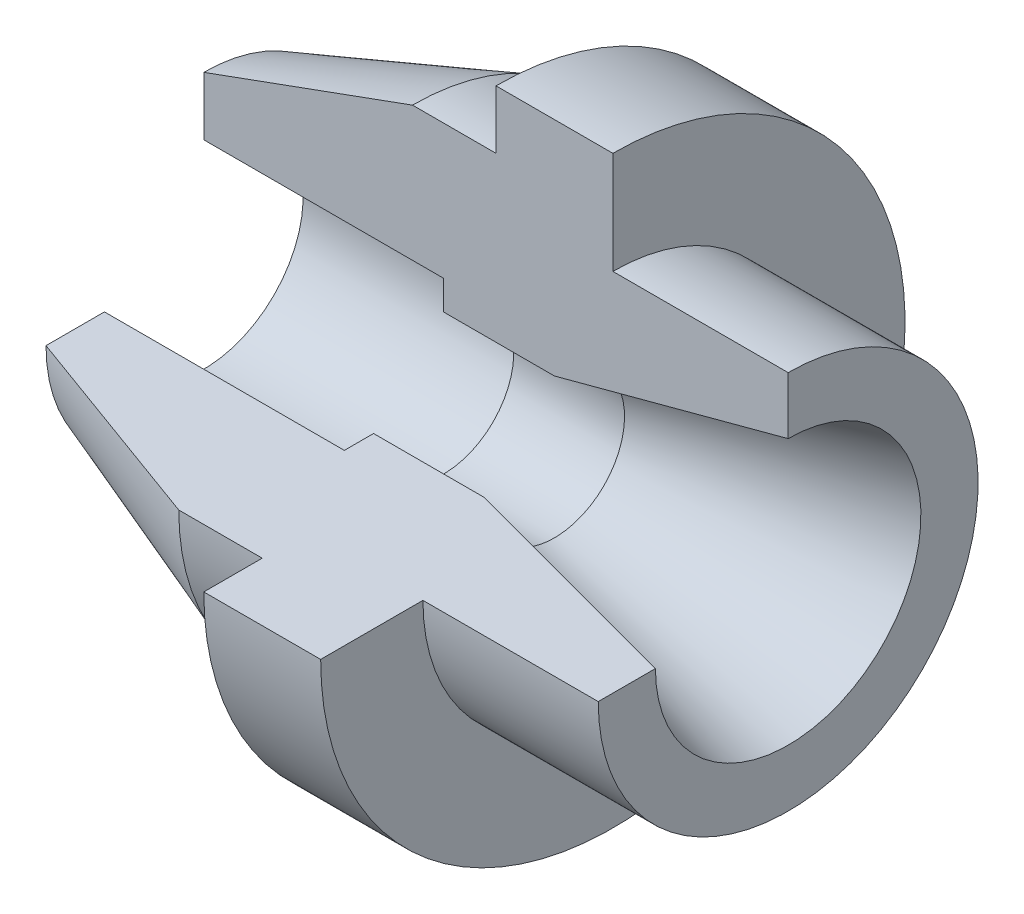
ISO-10303-21;
HEADER;
FILE_DESCRIPTION(('STEP AP214'),'2;1');
FILE_NAME('part.step','',(''),(''),'','','');
FILE_SCHEMA(('AUTOMOTIVE_DESIGN { 1 0 10303 214 1 1 1 1 }'));
ENDSEC;
DATA;
#1=APPLICATION_CONTEXT('core data for automotive mechanical design processes');
#2=APPLICATION_PROTOCOL_DEFINITION('international standard','automotive_design',2000,#1);
#3=PRODUCT_CONTEXT('',#1,'mechanical');
#4=PRODUCT('Part','Part','',(#3));
#5=PRODUCT_RELATED_PRODUCT_CATEGORY('part','',(#4));
#6=PRODUCT_DEFINITION_FORMATION('','',#4);
#7=PRODUCT_DEFINITION_CONTEXT('part definition',#1,'design');
#8=PRODUCT_DEFINITION('design','',#6,#7);
#9=PRODUCT_DEFINITION_SHAPE('','',#8);
#10=(LENGTH_UNIT() NAMED_UNIT(*) SI_UNIT(.MILLI.,.METRE.));
#11=(NAMED_UNIT(*) PLANE_ANGLE_UNIT() SI_UNIT($,.RADIAN.));
#12=(NAMED_UNIT(*) SI_UNIT($,.STERADIAN.) SOLID_ANGLE_UNIT());
#13=UNCERTAINTY_MEASURE_WITH_UNIT(LENGTH_MEASURE(1.E-05),#10,'distance_accuracy_value','');
#14=(GEOMETRIC_REPRESENTATION_CONTEXT(3) GLOBAL_UNCERTAINTY_ASSIGNED_CONTEXT((#13)) GLOBAL_UNIT_ASSIGNED_CONTEXT((#10,
#11,#12)) REPRESENTATION_CONTEXT('',''));
#15=CARTESIAN_POINT('',(0.,0.,0.));
#16=DIRECTION('',(0.,0.,1.));
#17=DIRECTION('',(1.,0.,0.));
#18=AXIS2_PLACEMENT_3D('',#15,#16,#17);
#19=CARTESIAN_POINT('',(0.,0.,0.));
#20=DIRECTION('',(0.,1.,0.));
#21=DIRECTION('',(-1.,0.,0.));
#22=AXIS2_PLACEMENT_3D('',#19,#20,#21);
#23=PLANE('',#22);
#24=DIRECTION('',(0.,0.,-1.));
#25=VECTOR('',#24,1.);
#26=CARTESIAN_POINT('',(45.4775032273314,3.40419430537206E-13,32.5));
#27=LINE('',#26,#25);
#28=CARTESIAN_POINT('',(45.4775032273314,3.40419430537206E-13,32.5));
#29=VERTEX_POINT('',#28);
#30=CARTESIAN_POINT('',(45.4775032273315,2.37958080814109E-13,22.7179676972443));
#31=VERTEX_POINT('',#30);
#32=EDGE_CURVE('E163',#29,#31,#27,.T.);
#33=ORIENTED_EDGE('',*,*,#32,.T.);
#34=DIRECTION('',(0.965925826289071,0.,0.258819045102511));
#35=VECTOR('',#34,1.);
#36=CARTESIAN_POINT('',(-39.3071064634961,0.,0.));
#37=LINE('',#36,#35);
#38=CARTESIAN_POINT('',(5.47750322733145,2.97691547303661E-13,11.9999999999998));
#39=VERTEX_POINT('',#38);
#40=EDGE_CURVE('E279',#31,#39,#37,.F.);
#41=ORIENTED_EDGE('',*,*,#40,.T.);
#42=DIRECTION('',(-1.,0.,0.));
#43=VECTOR('',#42,1.);
#44=CARTESIAN_POINT('',(-54.5224967726686,1.25693328198351E-13,11.9999999999998));
#45=LINE('',#44,#43);
#46=CARTESIAN_POINT('',(-13.4717319359584,1.25693328198351E-13,11.9999999999999));
#47=VERTEX_POINT('',#46);
#48=EDGE_CURVE('E276',#39,#47,#45,.T.);
#49=ORIENTED_EDGE('',*,*,#48,.T.);
#50=DIRECTION('',(0.,0.,1.));
#51=VECTOR('',#50,1.);
#52=CARTESIAN_POINT('',(-13.4717319359584,0.,0.));
#53=LINE('',#52,#51);
#54=CARTESIAN_POINT('',(-13.4717319359584,2.47937938225147E-13,16.9999999999999));
#55=VERTEX_POINT('',#54);
#56=EDGE_CURVE('E155',#47,#55,#53,.T.);
#57=ORIENTED_EDGE('',*,*,#56,.T.);
#58=DIRECTION('',(-1.,0.,0.));
#59=VECTOR('',#58,1.);
#60=CARTESIAN_POINT('',(-54.5224967726686,1.78065548280999E-13,16.9999999999999));
#61=LINE('',#60,#59);
#62=CARTESIAN_POINT('',(-54.5224967726685,2.47937938225148E-13,17.));
#63=VERTEX_POINT('',#62);
#64=EDGE_CURVE('E138',#55,#63,#61,.T.);
#65=ORIENTED_EDGE('',*,*,#64,.T.);
#66=DIRECTION('',(0.,0.,-1.));
#67=VECTOR('',#66,1.);
#68=CARTESIAN_POINT('',(-54.5224967726686,2.82809988446294E-13,27.));
#69=LINE('',#68,#67);
#70=CARTESIAN_POINT('',(-54.5224967726686,2.82809988446294E-13,27.));
#71=VERTEX_POINT('',#70);
#72=EDGE_CURVE('E152',#71,#63,#69,.T.);
#73=ORIENTED_EDGE('',*,*,#72,.F.);
#74=DIRECTION('',(0.93969262078591,0.,0.342020143325665));
#75=VECTOR('',#74,1.);
#76=CARTESIAN_POINT('',(-54.5224967726686,2.82809988446294E-13,27.));
#77=LINE('',#76,#75);
#78=CARTESIAN_POINT('',(-18.8052903197581,4.18977760661176E-13,40.));
#79=VERTEX_POINT('',#78);
#80=EDGE_CURVE('E162',#71,#79,#77,.T.);
#81=ORIENTED_EDGE('',*,*,#80,.T.);
#82=DIRECTION('',(1.,0.,0.));
#83=VECTOR('',#82,1.);
#84=CARTESIAN_POINT('',(-18.8052903197581,4.18977760661176E-13,40.));
#85=LINE('',#84,#83);
#86=CARTESIAN_POINT('',(-4.52249677266856,4.18977760661176E-13,40.));
#87=VERTEX_POINT('',#86);
#88=EDGE_CURVE('E167',#79,#87,#85,.T.);
#89=ORIENTED_EDGE('',*,*,#88,.T.);
#90=DIRECTION('',(0.,0.,1.));
#91=VECTOR('',#90,1.);
#92=CARTESIAN_POINT('',(-4.52249677266856,4.18977760661176E-13,40.));
#93=LINE('',#92,#91);
#94=CARTESIAN_POINT('',(-4.52249677266857,5.2372220082647E-13,50.));
#95=VERTEX_POINT('',#94);
#96=EDGE_CURVE('E176',#87,#95,#93,.T.);
#97=ORIENTED_EDGE('',*,*,#96,.T.);
#98=DIRECTION('',(1.,0.,0.));
#99=VECTOR('',#98,1.);
#100=CARTESIAN_POINT('',(-4.52249677266857,5.2372220082647E-13,50.));
#101=LINE('',#100,#99);
#102=CARTESIAN_POINT('',(15.4775032273314,5.2372220082647E-13,50.));
#103=VERTEX_POINT('',#102);
#104=EDGE_CURVE('E180',#95,#103,#101,.T.);
#105=ORIENTED_EDGE('',*,*,#104,.T.);
#106=DIRECTION('',(0.,0.,-1.));
#107=VECTOR('',#106,1.);
#108=CARTESIAN_POINT('',(15.4775032273314,5.2372220082647E-13,50.));
#109=LINE('',#108,#107);
#110=CARTESIAN_POINT('',(15.4775032273314,3.40419430537206E-13,32.5));
#111=VERTEX_POINT('',#110);
#112=EDGE_CURVE('E184',#103,#111,#109,.T.);
#113=ORIENTED_EDGE('',*,*,#112,.T.);
#114=DIRECTION('',(1.,0.,0.));
#115=VECTOR('',#114,1.);
#116=CARTESIAN_POINT('',(15.4775032273314,3.40419430537206E-13,32.5));
#117=LINE('',#116,#115);
#118=EDGE_CURVE('E169',#111,#29,#117,.T.);
#119=ORIENTED_EDGE('',*,*,#118,.T.);
#120=EDGE_LOOP('',(#33,#41,#49,#57,#65,#73,#81,#89,#97,#105,#113,#119));
#121=FACE_BOUND('',#120,.T.);
#122=ADVANCED_FACE('F47',(#121),#23,.T.);
#123=CARTESIAN_POINT('',(0.,0.,0.));
#124=DIRECTION('',(0.,0.,-1.));
#125=DIRECTION('',(-1.,0.,0.));
#126=AXIS2_PLACEMENT_3D('',#123,#124,#125);
#127=PLANE('',#126);
#128=DIRECTION('',(0.96592582628907,0.258819045102515,0.));
#129=VECTOR('',#128,1.);
#130=CARTESIAN_POINT('',(-39.3071064634961,0.,0.));
#131=LINE('',#130,#129);
#132=CARTESIAN_POINT('',(45.4775032273314,22.7179676972446,0.));
#133=VERTEX_POINT('',#132);
#134=CARTESIAN_POINT('',(5.47750322733141,12.,0.));
#135=VERTEX_POINT('',#134);
#136=EDGE_CURVE('E11',#133,#135,#131,.F.);
#137=ORIENTED_EDGE('',*,*,#136,.F.);
#138=DIRECTION('',(0.,-1.,0.));
#139=VECTOR('',#138,1.);
#140=CARTESIAN_POINT('',(45.4775032273314,32.5,0.));
#141=LINE('',#140,#139);
#142=CARTESIAN_POINT('',(45.4775032273314,32.5,0.));
#143=VERTEX_POINT('',#142);
#144=EDGE_CURVE('E235',#143,#133,#141,.T.);
#145=ORIENTED_EDGE('',*,*,#144,.F.);
#146=DIRECTION('',(1.,0.,0.));
#147=VECTOR('',#146,1.);
#148=CARTESIAN_POINT('',(15.4775032273314,32.5,0.));
#149=LINE('',#148,#147);
#150=CARTESIAN_POINT('',(15.4775032273314,32.5,0.));
#151=VERTEX_POINT('',#150);
#152=EDGE_CURVE('E242',#151,#143,#149,.T.);
#153=ORIENTED_EDGE('',*,*,#152,.F.);
#154=DIRECTION('',(0.,-1.,0.));
#155=VECTOR('',#154,1.);
#156=CARTESIAN_POINT('',(15.4775032273314,50.,0.));
#157=LINE('',#156,#155);
#158=CARTESIAN_POINT('',(15.4775032273314,50.,0.));
#159=VERTEX_POINT('',#158);
#160=EDGE_CURVE('E257',#159,#151,#157,.T.);
#161=ORIENTED_EDGE('',*,*,#160,.F.);
#162=DIRECTION('',(1.,0.,0.));
#163=VECTOR('',#162,1.);
#164=CARTESIAN_POINT('',(-4.52249677266857,50.,0.));
#165=LINE('',#164,#163);
#166=CARTESIAN_POINT('',(-4.52249677266857,50.,0.));
#167=VERTEX_POINT('',#166);
#168=EDGE_CURVE('E253',#167,#159,#165,.T.);
#169=ORIENTED_EDGE('',*,*,#168,.F.);
#170=DIRECTION('',(0.,1.,0.));
#171=VECTOR('',#170,1.);
#172=CARTESIAN_POINT('',(-4.52249677266856,40.,0.));
#173=LINE('',#172,#171);
#174=CARTESIAN_POINT('',(-4.52249677266856,40.,0.));
#175=VERTEX_POINT('',#174);
#176=EDGE_CURVE('E249',#175,#167,#173,.T.);
#177=ORIENTED_EDGE('',*,*,#176,.F.);
#178=DIRECTION('',(1.,0.,0.));
#179=VECTOR('',#178,1.);
#180=CARTESIAN_POINT('',(-18.8052903197581,40.,0.));
#181=LINE('',#180,#179);
#182=CARTESIAN_POINT('',(-18.8052903197581,40.,0.));
#183=VERTEX_POINT('',#182);
#184=EDGE_CURVE('E239',#183,#175,#181,.T.);
#185=ORIENTED_EDGE('',*,*,#184,.F.);
#186=DIRECTION('',(0.93969262078591,0.342020143325665,0.));
#187=VECTOR('',#186,1.);
#188=CARTESIAN_POINT('',(-54.5224967726686,27.,0.));
#189=LINE('',#188,#187);
#190=CARTESIAN_POINT('',(-54.5224967726686,27.,0.));
#191=VERTEX_POINT('',#190);
#192=EDGE_CURVE('E233',#191,#183,#189,.T.);
#193=ORIENTED_EDGE('',*,*,#192,.F.);
#194=DIRECTION('',(0.,-1.,0.));
#195=VECTOR('',#194,1.);
#196=CARTESIAN_POINT('',(-54.5224967726686,27.,0.));
#197=LINE('',#196,#195);
#198=CARTESIAN_POINT('',(-54.5224967726686,17.,0.));
#199=VERTEX_POINT('',#198);
#200=EDGE_CURVE('E230',#191,#199,#197,.T.);
#201=ORIENTED_EDGE('',*,*,#200,.T.);
#202=DIRECTION('',(-1.,0.,0.));
#203=VECTOR('',#202,1.);
#204=CARTESIAN_POINT('',(-54.5224967726686,16.9999999999999,0.));
#205=LINE('',#204,#203);
#206=CARTESIAN_POINT('',(-13.4717319359584,17.0000000000001,0.));
#207=VERTEX_POINT('',#206);
#208=EDGE_CURVE('E140',#207,#199,#205,.T.);
#209=ORIENTED_EDGE('',*,*,#208,.F.);
#210=DIRECTION('',(0.,1.,0.));
#211=VECTOR('',#210,1.);
#212=CARTESIAN_POINT('',(-13.4717319359584,0.,0.));
#213=LINE('',#212,#211);
#214=CARTESIAN_POINT('',(-13.4717319359585,12.,0.));
#215=VERTEX_POINT('',#214);
#216=EDGE_CURVE('E209',#215,#207,#213,.T.);
#217=ORIENTED_EDGE('',*,*,#216,.F.);
#218=DIRECTION('',(-1.,0.,0.));
#219=VECTOR('',#218,1.);
#220=CARTESIAN_POINT('',(-54.5224967726686,11.9999999999998,0.));
#221=LINE('',#220,#219);
#222=EDGE_CURVE('E56',#135,#215,#221,.T.);
#223=ORIENTED_EDGE('',*,*,#222,.F.);
#224=EDGE_LOOP('',(#137,#145,#153,#161,#169,#177,#185,#193,#201,#209,#217,#223));
#225=FACE_BOUND('',#224,.T.);
#226=ADVANCED_FACE('F228',(#225),#127,.F.);
#227=CARTESIAN_POINT('',(88.99,0.,0.));
#228=DIRECTION('',(1.,0.,0.));
#229=DIRECTION('',(0.,0.,-1.));
#230=AXIS2_PLACEMENT_3D('',#227,#228,#229);
#231=CYLINDRICAL_SURFACE('',#230,32.5);
#232=CARTESIAN_POINT('',(45.4775032273314,0.,0.));
#233=DIRECTION('',(1.,0.,0.));
#234=DIRECTION('',(0.,0.,-1.));
#235=AXIS2_PLACEMENT_3D('',#232,#233,#234);
#236=CIRCLE('',#235,32.5);
#237=EDGE_CURVE('E204',#29,#143,#236,.T.);
#238=ORIENTED_EDGE('',*,*,#237,.F.);
#239=ORIENTED_EDGE('',*,*,#118,.F.);
#240=CARTESIAN_POINT('',(15.4775032273314,0.,0.));
#241=DIRECTION('',(1.,0.,0.));
#242=DIRECTION('',(0.,0.,-1.));
#243=AXIS2_PLACEMENT_3D('',#240,#241,#242);
#244=CIRCLE('',#243,32.5);
#245=EDGE_CURVE('E71',#111,#151,#244,.T.);
#246=ORIENTED_EDGE('',*,*,#245,.T.);
#247=ORIENTED_EDGE('',*,*,#152,.T.);
#248=EDGE_LOOP('',(#238,#239,#246,#247));
#249=FACE_BOUND('',#248,.T.);
#250=ADVANCED_FACE('F283',(#249),#231,.T.);
#251=CARTESIAN_POINT('',(45.4775032273314,3.40419430537206E-13,32.5));
#252=DIRECTION('',(-1.,0.,0.));
#253=DIRECTION('',(0.,0.,1.));
#254=AXIS2_PLACEMENT_3D('',#251,#252,#253);
#255=PLANE('',#254);
#256=CARTESIAN_POINT('',(45.4775032273315,3.40419430537206E-13,0.));
#257=DIRECTION('',(-1.,0.,0.));
#258=DIRECTION('',(0.,-1.,0.));
#259=AXIS2_PLACEMENT_3D('',#256,#257,#258);
#260=CIRCLE('',#259,22.7179676972443);
#261=EDGE_CURVE('E157',#133,#31,#260,.T.);
#262=ORIENTED_EDGE('',*,*,#261,.T.);
#263=ORIENTED_EDGE('',*,*,#32,.F.);
#264=ORIENTED_EDGE('',*,*,#237,.T.);
#265=ORIENTED_EDGE('',*,*,#144,.T.);
#266=EDGE_LOOP('',(#262,#263,#264,#265));
#267=FACE_BOUND('',#266,.T.);
#268=ADVANCED_FACE('F49',(#267),#255,.F.);
#269=CARTESIAN_POINT('',(-54.5224967726686,2.82809988446294E-13,27.));
#270=DIRECTION('',(-1.,0.,0.));
#271=DIRECTION('',(0.,0.,1.));
#272=AXIS2_PLACEMENT_3D('',#269,#270,#271);
#273=PLANE('',#272);
#274=ORIENTED_EDGE('',*,*,#72,.T.);
#275=CARTESIAN_POINT('',(-54.5224967726685,0.,0.));
#276=DIRECTION('',(-1.,0.,0.));
#277=DIRECTION('',(0.,-1.,0.));
#278=AXIS2_PLACEMENT_3D('',#275,#276,#277);
#279=CIRCLE('',#278,17.);
#280=EDGE_CURVE('E135',#199,#63,#279,.T.);
#281=ORIENTED_EDGE('',*,*,#280,.F.);
#282=ORIENTED_EDGE('',*,*,#200,.F.);
#283=CARTESIAN_POINT('',(-54.5224967726686,0.,0.));
#284=DIRECTION('',(1.,0.,0.));
#285=DIRECTION('',(0.,0.,-1.));
#286=AXIS2_PLACEMENT_3D('',#283,#284,#285);
#287=CIRCLE('',#286,27.);
#288=EDGE_CURVE('E160',#71,#191,#287,.T.);
#289=ORIENTED_EDGE('',*,*,#288,.F.);
#290=EDGE_LOOP('',(#274,#281,#282,#289));
#291=FACE_BOUND('',#290,.T.);
#292=ADVANCED_FACE('F159',(#291),#273,.T.);
#293=CARTESIAN_POINT('',(-54.5224967726686,0.,0.));
#294=DIRECTION('',(1.,0.,0.));
#295=DIRECTION('',(0.,0.,-1.));
#296=AXIS2_PLACEMENT_3D('',#293,#294,#295);
#297=CONICAL_SURFACE('',#296,27.,0.349065850398862);
#298=CARTESIAN_POINT('',(-18.8052903197581,0.,0.));
#299=DIRECTION('',(1.,0.,0.));
#300=DIRECTION('',(0.,0.,-1.));
#301=AXIS2_PLACEMENT_3D('',#298,#299,#300);
#302=CIRCLE('',#301,40.);
#303=EDGE_CURVE('E199',#79,#183,#302,.T.);
#304=ORIENTED_EDGE('',*,*,#303,.F.);
#305=ORIENTED_EDGE('',*,*,#80,.F.);
#306=ORIENTED_EDGE('',*,*,#288,.T.);
#307=ORIENTED_EDGE('',*,*,#192,.T.);
#308=EDGE_LOOP('',(#304,#305,#306,#307));
#309=FACE_BOUND('',#308,.T.);
#310=ADVANCED_FACE('F316',(#309),#297,.T.);
#311=CARTESIAN_POINT('',(88.99,0.,0.));
#312=DIRECTION('',(1.,0.,0.));
#313=DIRECTION('',(0.,0.,-1.));
#314=AXIS2_PLACEMENT_3D('',#311,#312,#313);
#315=CYLINDRICAL_SURFACE('',#314,40.);
#316=CARTESIAN_POINT('',(-4.52249677266857,0.,0.));
#317=DIRECTION('',(1.,0.,0.));
#318=DIRECTION('',(0.,0.,-1.));
#319=AXIS2_PLACEMENT_3D('',#316,#317,#318);
#320=CIRCLE('',#319,40.);
#321=EDGE_CURVE('E196',#87,#175,#320,.T.);
#322=ORIENTED_EDGE('',*,*,#321,.F.);
#323=ORIENTED_EDGE('',*,*,#88,.F.);
#324=ORIENTED_EDGE('',*,*,#303,.T.);
#325=ORIENTED_EDGE('',*,*,#184,.T.);
#326=EDGE_LOOP('',(#322,#323,#324,#325));
#327=FACE_BOUND('',#326,.T.);
#328=ADVANCED_FACE('F312',(#327),#315,.T.);
#329=CARTESIAN_POINT('',(-4.52249677266857,4.18977760661176E-13,40.));
#330=DIRECTION('',(1.,0.,0.));
#331=DIRECTION('',(0.,0.,-1.));
#332=AXIS2_PLACEMENT_3D('',#329,#330,#331);
#333=PLANE('',#332);
#334=CARTESIAN_POINT('',(-4.52249677266857,0.,0.));
#335=DIRECTION('',(1.,0.,0.));
#336=DIRECTION('',(0.,0.,-1.));
#337=AXIS2_PLACEMENT_3D('',#334,#335,#336);
#338=CIRCLE('',#337,50.);
#339=EDGE_CURVE('E193',#95,#167,#338,.T.);
#340=ORIENTED_EDGE('',*,*,#339,.F.);
#341=ORIENTED_EDGE('',*,*,#96,.F.);
#342=ORIENTED_EDGE('',*,*,#321,.T.);
#343=ORIENTED_EDGE('',*,*,#176,.T.);
#344=EDGE_LOOP('',(#340,#341,#342,#343));
#345=FACE_BOUND('',#344,.T.);
#346=ADVANCED_FACE('F308',(#345),#333,.F.);
#347=CARTESIAN_POINT('',(88.99,0.,0.));
#348=DIRECTION('',(1.,0.,0.));
#349=DIRECTION('',(0.,0.,-1.));
#350=AXIS2_PLACEMENT_3D('',#347,#348,#349);
#351=CYLINDRICAL_SURFACE('',#350,50.);
#352=CARTESIAN_POINT('',(15.4775032273314,0.,0.));
#353=DIRECTION('',(1.,0.,0.));
#354=DIRECTION('',(0.,0.,-1.));
#355=AXIS2_PLACEMENT_3D('',#352,#353,#354);
#356=CIRCLE('',#355,50.);
#357=EDGE_CURVE('E190',#103,#159,#356,.T.);
#358=ORIENTED_EDGE('',*,*,#357,.F.);
#359=ORIENTED_EDGE('',*,*,#104,.F.);
#360=ORIENTED_EDGE('',*,*,#339,.T.);
#361=ORIENTED_EDGE('',*,*,#168,.T.);
#362=EDGE_LOOP('',(#358,#359,#360,#361));
#363=FACE_BOUND('',#362,.T.);
#364=ADVANCED_FACE('F295',(#363),#351,.T.);
#365=CARTESIAN_POINT('',(15.4775032273314,5.2372220082647E-13,50.));
#366=DIRECTION('',(-1.,0.,0.));
#367=DIRECTION('',(0.,0.,1.));
#368=AXIS2_PLACEMENT_3D('',#365,#366,#367);
#369=PLANE('',#368);
#370=ORIENTED_EDGE('',*,*,#112,.F.);
#371=ORIENTED_EDGE('',*,*,#357,.T.);
#372=ORIENTED_EDGE('',*,*,#160,.T.);
#373=ORIENTED_EDGE('',*,*,#245,.F.);
#374=EDGE_LOOP('',(#370,#371,#372,#373));
#375=FACE_BOUND('',#374,.T.);
#376=ADVANCED_FACE('F287',(#375),#369,.F.);
#377=CARTESIAN_POINT('',(45.4775032273315,3.40419430537206E-13,0.));
#378=DIRECTION('',(1.,0.,0.));
#379=DIRECTION('',(0.,1.,0.));
#380=AXIS2_PLACEMENT_3D('',#377,#378,#379);
#381=CONICAL_SURFACE('',#380,22.7179676972443,0.26179938779914);
#382=ORIENTED_EDGE('',*,*,#261,.F.);
#383=ORIENTED_EDGE('',*,*,#136,.T.);
#384=CARTESIAN_POINT('',(5.47750322733145,2.04251658322323E-13,0.));
#385=DIRECTION('',(-1.,0.,0.));
#386=DIRECTION('',(0.,-1.,0.));
#387=AXIS2_PLACEMENT_3D('',#384,#385,#386);
#388=CIRCLE('',#387,11.9999999999998);
#389=EDGE_CURVE('E220',#135,#39,#388,.T.);
#390=ORIENTED_EDGE('',*,*,#389,.T.);
#391=ORIENTED_EDGE('',*,*,#40,.F.);
#392=EDGE_LOOP('',(#382,#383,#390,#391));
#393=FACE_BOUND('',#392,.T.);
#394=ADVANCED_FACE('F285',(#393),#381,.F.);
#395=CARTESIAN_POINT('',(-54.5224967726686,0.,0.));
#396=DIRECTION('',(-1.,0.,0.));
#397=DIRECTION('',(0.,-1.,0.));
#398=AXIS2_PLACEMENT_3D('',#395,#396,#397);
#399=CYLINDRICAL_SURFACE('',#398,11.9999999999998);
#400=ORIENTED_EDGE('',*,*,#389,.F.);
#401=ORIENTED_EDGE('',*,*,#222,.T.);
#402=CARTESIAN_POINT('',(-13.4717319359584,1.39744779888296E-13,0.));
#403=DIRECTION('',(-1.,0.,0.));
#404=DIRECTION('',(0.,-1.,0.));
#405=AXIS2_PLACEMENT_3D('',#402,#403,#404);
#406=CIRCLE('',#405,11.9999999999999);
#407=EDGE_CURVE('E218',#215,#47,#406,.T.);
#408=ORIENTED_EDGE('',*,*,#407,.T.);
#409=ORIENTED_EDGE('',*,*,#48,.F.);
#410=EDGE_LOOP('',(#400,#401,#408,#409));
#411=FACE_BOUND('',#410,.T.);
#412=ADVANCED_FACE('F217',(#411),#399,.F.);
#413=CARTESIAN_POINT('',(-13.4717319359585,12.,0.));
#414=DIRECTION('',(-1.,0.,0.));
#415=DIRECTION('',(0.,-1.,0.));
#416=AXIS2_PLACEMENT_3D('',#413,#414,#415);
#417=PLANE('',#416);
#418=ORIENTED_EDGE('',*,*,#407,.F.);
#419=ORIENTED_EDGE('',*,*,#216,.T.);
#420=CARTESIAN_POINT('',(-13.4717319359584,1.39744779888296E-13,0.));
#421=DIRECTION('',(-1.,0.,0.));
#422=DIRECTION('',(0.,-1.,0.));
#423=AXIS2_PLACEMENT_3D('',#420,#421,#422);
#424=CIRCLE('',#423,16.9999999999999);
#425=EDGE_CURVE('E63',#207,#55,#424,.T.);
#426=ORIENTED_EDGE('',*,*,#425,.T.);
#427=ORIENTED_EDGE('',*,*,#56,.F.);
#428=EDGE_LOOP('',(#418,#419,#426,#427));
#429=FACE_BOUND('',#428,.T.);
#430=ADVANCED_FACE('F225',(#429),#417,.T.);
#431=CARTESIAN_POINT('',(-54.5224967726686,0.,0.));
#432=DIRECTION('',(-1.,0.,0.));
#433=DIRECTION('',(0.,-1.,0.));
#434=AXIS2_PLACEMENT_3D('',#431,#432,#433);
#435=CYLINDRICAL_SURFACE('',#434,16.9999999999999);
#436=ORIENTED_EDGE('',*,*,#425,.F.);
#437=ORIENTED_EDGE('',*,*,#208,.T.);
#438=ORIENTED_EDGE('',*,*,#280,.T.);
#439=ORIENTED_EDGE('',*,*,#64,.F.);
#440=EDGE_LOOP('',(#436,#437,#438,#439));
#441=FACE_BOUND('',#440,.T.);
#442=ADVANCED_FACE('F137',(#441),#435,.F.);
#443=CLOSED_SHELL('',(#122,#226,#250,#268,#292,#310,#328,#346,#364,#376,#394,#412,#430,#442));
#444=MANIFOLD_SOLID_BREP('B2',#443);
#445=ADVANCED_BREP_SHAPE_REPRESENTATION('',(#18,#444),#14);
#446=SHAPE_DEFINITION_REPRESENTATION(#9,#445);
ENDSEC;
END-ISO-10303-21;
